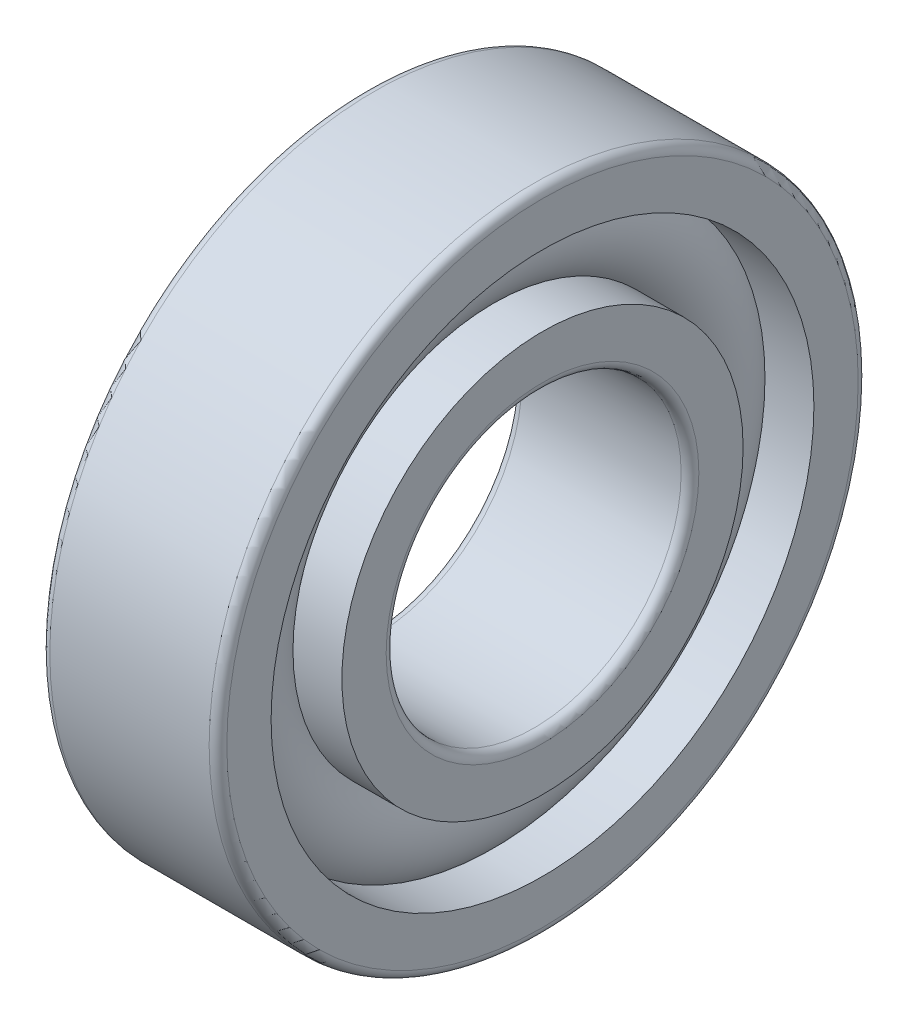
ISO-10303-21;
HEADER;
FILE_DESCRIPTION(('STEP AP214'),'2;1');
FILE_NAME('part.step','',(''),(''),'','','');
FILE_SCHEMA(('AUTOMOTIVE_DESIGN { 1 0 10303 214 1 1 1 1 }'));
ENDSEC;
DATA;
#1=APPLICATION_CONTEXT('core data for automotive mechanical design processes');
#2=APPLICATION_PROTOCOL_DEFINITION('international standard','automotive_design',2000,#1);
#3=PRODUCT_CONTEXT('',#1,'mechanical');
#4=PRODUCT('Part','Part','',(#3));
#5=PRODUCT_RELATED_PRODUCT_CATEGORY('part','',(#4));
#6=PRODUCT_DEFINITION_FORMATION('','',#4);
#7=PRODUCT_DEFINITION_CONTEXT('part definition',#1,'design');
#8=PRODUCT_DEFINITION('design','',#6,#7);
#9=PRODUCT_DEFINITION_SHAPE('','',#8);
#10=(LENGTH_UNIT() NAMED_UNIT(*) SI_UNIT(.MILLI.,.METRE.));
#11=(NAMED_UNIT(*) PLANE_ANGLE_UNIT() SI_UNIT($,.RADIAN.));
#12=(NAMED_UNIT(*) SI_UNIT($,.STERADIAN.) SOLID_ANGLE_UNIT());
#13=UNCERTAINTY_MEASURE_WITH_UNIT(LENGTH_MEASURE(1.E-05),#10,'distance_accuracy_value','');
#14=(GEOMETRIC_REPRESENTATION_CONTEXT(3) GLOBAL_UNCERTAINTY_ASSIGNED_CONTEXT((#13)) GLOBAL_UNIT_ASSIGNED_CONTEXT((#10,
#11,#12)) REPRESENTATION_CONTEXT('',''));
#15=CARTESIAN_POINT('',(0.,0.,0.));
#16=DIRECTION('',(0.,0.,1.));
#17=DIRECTION('',(1.,0.,0.));
#18=AXIS2_PLACEMENT_3D('',#15,#16,#17);
#19=CARTESIAN_POINT('',(0.,0.,0.));
#20=DIRECTION('',(-1.,0.,0.));
#21=DIRECTION('',(0.,0.,1.));
#22=AXIS2_PLACEMENT_3D('',#19,#20,#21);
#23=TOROIDAL_SURFACE('',#22,4.,0.9);
#24=CARTESIAN_POINT('',(0.670820393249932,0.,0.));
#25=DIRECTION('',(-1.,0.,0.));
#26=DIRECTION('',(0.,0.,1.));
#27=AXIS2_PLACEMENT_3D('',#24,#25,#26);
#28=CIRCLE('',#27,4.6);
#29=CARTESIAN_POINT('',(0.670820393249932,0.,4.6));
#30=VERTEX_POINT('',#29);
#31=EDGE_CURVE('E36',#30,#30,#28,.F.);
#32=ORIENTED_EDGE('',*,*,#31,.T.);
#33=EDGE_LOOP('',(#32));
#34=FACE_BOUND('',#33,.T.);
#35=CARTESIAN_POINT('',(0.670820393249936,0.,0.));
#36=DIRECTION('',(-1.,0.,0.));
#37=DIRECTION('',(0.,0.,1.));
#38=AXIS2_PLACEMENT_3D('',#35,#36,#37);
#39=CIRCLE('',#38,3.4);
#40=CARTESIAN_POINT('',(0.670820393249936,0.,3.4));
#41=VERTEX_POINT('',#40);
#42=EDGE_CURVE('E10',#41,#41,#39,.T.);
#43=ORIENTED_EDGE('',*,*,#42,.T.);
#44=EDGE_LOOP('',(#43));
#45=FACE_BOUND('',#44,.T.);
#46=ADVANCED_FACE('F32',(#34,#45),#23,.T.);
#47=CARTESIAN_POINT('',(-20.6375,0.,0.));
#48=DIRECTION('',(1.,0.,0.));
#49=DIRECTION('',(0.,0.,-1.));
#50=AXIS2_PLACEMENT_3D('',#47,#48,#49);
#51=CYLINDRICAL_SURFACE('',#50,3.4);
#52=CARTESIAN_POINT('',(1.5,0.,0.));
#53=DIRECTION('',(1.,0.,0.));
#54=DIRECTION('',(0.,0.,-1.));
#55=AXIS2_PLACEMENT_3D('',#52,#53,#54);
#56=CIRCLE('',#55,3.4);
#57=CARTESIAN_POINT('',(1.5,0.,-3.4));
#58=VERTEX_POINT('',#57);
#59=EDGE_CURVE('E45',#58,#58,#56,.T.);
#60=ORIENTED_EDGE('',*,*,#59,.F.);
#61=EDGE_LOOP('',(#60));
#62=FACE_BOUND('',#61,.T.);
#63=ORIENTED_EDGE('',*,*,#42,.F.);
#64=EDGE_LOOP('',(#63));
#65=FACE_BOUND('',#64,.T.);
#66=ADVANCED_FACE('F84',(#62,#65),#51,.T.);
#67=CARTESIAN_POINT('',(-20.6375,0.,0.));
#68=DIRECTION('',(1.,0.,0.));
#69=DIRECTION('',(0.,0.,-1.));
#70=AXIS2_PLACEMENT_3D('',#67,#68,#69);
#71=CYLINDRICAL_SURFACE('',#70,3.4);
#72=CARTESIAN_POINT('',(-1.5,0.,0.));
#73=DIRECTION('',(1.,0.,0.));
#74=DIRECTION('',(0.,0.,-1.));
#75=AXIS2_PLACEMENT_3D('',#72,#73,#74);
#76=CIRCLE('',#75,3.4);
#77=CARTESIAN_POINT('',(-1.5,0.,-3.4));
#78=VERTEX_POINT('',#77);
#79=EDGE_CURVE('E54',#78,#78,#76,.T.);
#80=ORIENTED_EDGE('',*,*,#79,.T.);
#81=EDGE_LOOP('',(#80));
#82=FACE_BOUND('',#81,.T.);
#83=CARTESIAN_POINT('',(-0.670820393249936,0.,0.));
#84=DIRECTION('',(1.,0.,0.));
#85=DIRECTION('',(0.,0.,-1.));
#86=AXIS2_PLACEMENT_3D('',#83,#84,#85);
#87=CIRCLE('',#86,3.4);
#88=CARTESIAN_POINT('',(-0.670820393249936,0.,-3.4));
#89=VERTEX_POINT('',#88);
#90=EDGE_CURVE('E40',#89,#89,#87,.T.);
#91=ORIENTED_EDGE('',*,*,#90,.F.);
#92=EDGE_LOOP('',(#91));
#93=FACE_BOUND('',#92,.T.);
#94=ADVANCED_FACE('F87',(#82,#93),#71,.T.);
#95=CARTESIAN_POINT('',(1.5,2.65,0.));
#96=DIRECTION('',(1.,0.,0.));
#97=DIRECTION('',(0.,0.,-1.));
#98=AXIS2_PLACEMENT_3D('',#95,#96,#97);
#99=PLANE('',#98);
#100=ORIENTED_EDGE('',*,*,#59,.T.);
#101=EDGE_LOOP('',(#100));
#102=FACE_BOUND('',#101,.T.);
#103=CARTESIAN_POINT('',(1.5,0.,0.));
#104=DIRECTION('',(1.,0.,0.));
#105=DIRECTION('',(0.,0.,-1.));
#106=AXIS2_PLACEMENT_3D('',#103,#104,#105);
#107=CIRCLE('',#106,2.65);
#108=CARTESIAN_POINT('',(1.5,0.,-2.65));
#109=VERTEX_POINT('',#108);
#110=EDGE_CURVE('E76',#109,#109,#107,.T.);
#111=ORIENTED_EDGE('',*,*,#110,.F.);
#112=EDGE_LOOP('',(#111));
#113=FACE_BOUND('',#112,.T.);
#114=ADVANCED_FACE('F81',(#102,#113),#99,.T.);
#115=CARTESIAN_POINT('',(1.35,0.,0.));
#116=DIRECTION('',(1.,0.,0.));
#117=DIRECTION('',(0.,0.,-1.));
#118=AXIS2_PLACEMENT_3D('',#115,#116,#117);
#119=TOROIDAL_SURFACE('',#118,2.65,0.149999999999999);
#120=ORIENTED_EDGE('',*,*,#110,.T.);
#121=EDGE_LOOP('',(#120));
#122=FACE_BOUND('',#121,.T.);
#123=CARTESIAN_POINT('',(1.35,0.,0.));
#124=DIRECTION('',(1.,0.,0.));
#125=DIRECTION('',(0.,0.,-1.));
#126=AXIS2_PLACEMENT_3D('',#123,#124,#125);
#127=CIRCLE('',#126,2.5);
#128=CARTESIAN_POINT('',(1.35,0.,-2.5));
#129=VERTEX_POINT('',#128);
#130=EDGE_CURVE('E73',#129,#129,#127,.T.);
#131=ORIENTED_EDGE('',*,*,#130,.F.);
#132=EDGE_LOOP('',(#131));
#133=FACE_BOUND('',#132,.T.);
#134=ADVANCED_FACE('F98',(#122,#133),#119,.T.);
#135=CARTESIAN_POINT('',(-20.6375,0.,0.));
#136=DIRECTION('',(1.,0.,0.));
#137=DIRECTION('',(0.,0.,-1.));
#138=AXIS2_PLACEMENT_3D('',#135,#136,#137);
#139=CYLINDRICAL_SURFACE('',#138,2.5);
#140=ORIENTED_EDGE('',*,*,#130,.T.);
#141=EDGE_LOOP('',(#140));
#142=FACE_BOUND('',#141,.T.);
#143=CARTESIAN_POINT('',(-1.35,0.,0.));
#144=DIRECTION('',(1.,0.,0.));
#145=DIRECTION('',(0.,0.,-1.));
#146=AXIS2_PLACEMENT_3D('',#143,#144,#145);
#147=CIRCLE('',#146,2.5);
#148=CARTESIAN_POINT('',(-1.35,0.,-2.5));
#149=VERTEX_POINT('',#148);
#150=EDGE_CURVE('E70',#149,#149,#147,.T.);
#151=ORIENTED_EDGE('',*,*,#150,.F.);
#152=EDGE_LOOP('',(#151));
#153=FACE_BOUND('',#152,.T.);
#154=ADVANCED_FACE('F101',(#142,#153),#139,.F.);
#155=CARTESIAN_POINT('',(-1.35,0.,0.));
#156=DIRECTION('',(1.,0.,0.));
#157=DIRECTION('',(0.,0.,-1.));
#158=AXIS2_PLACEMENT_3D('',#155,#156,#157);
#159=TOROIDAL_SURFACE('',#158,2.65,0.149999999999999);
#160=ORIENTED_EDGE('',*,*,#150,.T.);
#161=EDGE_LOOP('',(#160));
#162=FACE_BOUND('',#161,.T.);
#163=CARTESIAN_POINT('',(-1.5,0.,0.));
#164=DIRECTION('',(1.,0.,0.));
#165=DIRECTION('',(0.,0.,-1.));
#166=AXIS2_PLACEMENT_3D('',#163,#164,#165);
#167=CIRCLE('',#166,2.65);
#168=CARTESIAN_POINT('',(-1.5,0.,-2.65));
#169=VERTEX_POINT('',#168);
#170=EDGE_CURVE('E67',#169,#169,#167,.T.);
#171=ORIENTED_EDGE('',*,*,#170,.F.);
#172=EDGE_LOOP('',(#171));
#173=FACE_BOUND('',#172,.T.);
#174=ADVANCED_FACE('F105',(#162,#173),#159,.T.);
#175=CARTESIAN_POINT('',(-1.5,3.4,0.));
#176=DIRECTION('',(-1.,0.,0.));
#177=DIRECTION('',(0.,0.,1.));
#178=AXIS2_PLACEMENT_3D('',#175,#176,#177);
#179=PLANE('',#178);
#180=ORIENTED_EDGE('',*,*,#170,.T.);
#181=EDGE_LOOP('',(#180));
#182=FACE_BOUND('',#181,.T.);
#183=ORIENTED_EDGE('',*,*,#79,.F.);
#184=EDGE_LOOP('',(#183));
#185=FACE_BOUND('',#184,.T.);
#186=ADVANCED_FACE('F109',(#182,#185),#179,.T.);
#187=CARTESIAN_POINT('',(-0.670820393249932,0.,0.));
#188=DIRECTION('',(1.,0.,0.));
#189=DIRECTION('',(0.,0.,-1.));
#190=AXIS2_PLACEMENT_3D('',#187,#188,#189);
#191=CIRCLE('',#190,4.6);
#192=CARTESIAN_POINT('',(-0.670820393249932,0.,-4.6));
#193=VERTEX_POINT('',#192);
#194=EDGE_CURVE('E48',#193,#193,#191,.F.);
#195=ORIENTED_EDGE('',*,*,#194,.T.);
#196=EDGE_LOOP('',(#195));
#197=FACE_BOUND('',#196,.T.);
#198=ORIENTED_EDGE('',*,*,#90,.T.);
#199=EDGE_LOOP('',(#198));
#200=FACE_BOUND('',#199,.T.);
#201=ADVANCED_FACE('F34',(#197,#200),#23,.T.);
#202=CARTESIAN_POINT('',(-20.6375,0.,0.));
#203=DIRECTION('',(1.,0.,0.));
#204=DIRECTION('',(0.,0.,-1.));
#205=AXIS2_PLACEMENT_3D('',#202,#203,#204);
#206=CYLINDRICAL_SURFACE('',#205,4.6);
#207=CARTESIAN_POINT('',(1.5,0.,0.));
#208=DIRECTION('',(1.,0.,0.));
#209=DIRECTION('',(0.,0.,-1.));
#210=AXIS2_PLACEMENT_3D('',#207,#208,#209);
#211=CIRCLE('',#210,4.6);
#212=CARTESIAN_POINT('',(1.5,0.,-4.6));
#213=VERTEX_POINT('',#212);
#214=EDGE_CURVE('E50',#213,#213,#211,.T.);
#215=ORIENTED_EDGE('',*,*,#214,.T.);
#216=EDGE_LOOP('',(#215));
#217=FACE_BOUND('',#216,.T.);
#218=ORIENTED_EDGE('',*,*,#31,.F.);
#219=EDGE_LOOP('',(#218));
#220=FACE_BOUND('',#219,.T.);
#221=ADVANCED_FACE('F114',(#217,#220),#206,.F.);
#222=CARTESIAN_POINT('',(-20.6375,0.,0.));
#223=DIRECTION('',(1.,0.,0.));
#224=DIRECTION('',(0.,0.,-1.));
#225=AXIS2_PLACEMENT_3D('',#222,#223,#224);
#226=CYLINDRICAL_SURFACE('',#225,4.6);
#227=CARTESIAN_POINT('',(-1.5,0.,0.));
#228=DIRECTION('',(1.,0.,0.));
#229=DIRECTION('',(0.,0.,-1.));
#230=AXIS2_PLACEMENT_3D('',#227,#228,#229);
#231=CIRCLE('',#230,4.6);
#232=CARTESIAN_POINT('',(-1.5,0.,-4.6));
#233=VERTEX_POINT('',#232);
#234=EDGE_CURVE('E145',#233,#233,#231,.T.);
#235=ORIENTED_EDGE('',*,*,#234,.F.);
#236=EDGE_LOOP('',(#235));
#237=FACE_BOUND('',#236,.T.);
#238=ORIENTED_EDGE('',*,*,#194,.F.);
#239=EDGE_LOOP('',(#238));
#240=FACE_BOUND('',#239,.T.);
#241=ADVANCED_FACE('F117',(#237,#240),#226,.F.);
#242=CARTESIAN_POINT('',(1.5,5.35,0.));
#243=DIRECTION('',(1.,0.,0.));
#244=DIRECTION('',(0.,0.,-1.));
#245=AXIS2_PLACEMENT_3D('',#242,#243,#244);
#246=PLANE('',#245);
#247=CARTESIAN_POINT('',(1.5,0.,0.));
#248=DIRECTION('',(1.,0.,0.));
#249=DIRECTION('',(0.,0.,-1.));
#250=AXIS2_PLACEMENT_3D('',#247,#248,#249);
#251=CIRCLE('',#250,5.35);
#252=CARTESIAN_POINT('',(1.5,0.,-5.35));
#253=VERTEX_POINT('',#252);
#254=EDGE_CURVE('E56',#253,#253,#251,.T.);
#255=ORIENTED_EDGE('',*,*,#254,.T.);
#256=EDGE_LOOP('',(#255));
#257=FACE_BOUND('',#256,.T.);
#258=ORIENTED_EDGE('',*,*,#214,.F.);
#259=EDGE_LOOP('',(#258));
#260=FACE_BOUND('',#259,.T.);
#261=ADVANCED_FACE('F118',(#257,#260),#246,.T.);
#262=CARTESIAN_POINT('',(1.35,0.,0.));
#263=DIRECTION('',(1.,0.,0.));
#264=DIRECTION('',(0.,0.,-1.));
#265=AXIS2_PLACEMENT_3D('',#262,#263,#264);
#266=TOROIDAL_SURFACE('',#265,5.35,0.149999999999999);
#267=CARTESIAN_POINT('',(1.35,0.,0.));
#268=DIRECTION('',(1.,0.,0.));
#269=DIRECTION('',(0.,0.,-1.));
#270=AXIS2_PLACEMENT_3D('',#267,#268,#269);
#271=CIRCLE('',#270,5.5);
#272=CARTESIAN_POINT('',(1.35,0.,-5.5));
#273=VERTEX_POINT('',#272);
#274=EDGE_CURVE('E61',#273,#273,#271,.T.);
#275=ORIENTED_EDGE('',*,*,#274,.T.);
#276=EDGE_LOOP('',(#275));
#277=FACE_BOUND('',#276,.T.);
#278=ORIENTED_EDGE('',*,*,#254,.F.);
#279=EDGE_LOOP('',(#278));
#280=FACE_BOUND('',#279,.T.);
#281=ADVANCED_FACE('F121',(#277,#280),#266,.T.);
#282=CARTESIAN_POINT('',(-20.6375,0.,0.));
#283=DIRECTION('',(1.,0.,0.));
#284=DIRECTION('',(0.,0.,-1.));
#285=AXIS2_PLACEMENT_3D('',#282,#283,#284);
#286=CYLINDRICAL_SURFACE('',#285,5.5);
#287=CARTESIAN_POINT('',(-1.35,0.,0.));
#288=DIRECTION('',(1.,0.,0.));
#289=DIRECTION('',(0.,0.,-1.));
#290=AXIS2_PLACEMENT_3D('',#287,#288,#289);
#291=CIRCLE('',#290,5.5);
#292=CARTESIAN_POINT('',(-1.35,0.,-5.5));
#293=VERTEX_POINT('',#292);
#294=EDGE_CURVE('E149',#293,#293,#291,.T.);
#295=ORIENTED_EDGE('',*,*,#294,.T.);
#296=EDGE_LOOP('',(#295));
#297=FACE_BOUND('',#296,.T.);
#298=ORIENTED_EDGE('',*,*,#274,.F.);
#299=EDGE_LOOP('',(#298));
#300=FACE_BOUND('',#299,.T.);
#301=ADVANCED_FACE('F125',(#297,#300),#286,.T.);
#302=CARTESIAN_POINT('',(-1.35,0.,0.));
#303=DIRECTION('',(1.,0.,0.));
#304=DIRECTION('',(0.,0.,-1.));
#305=AXIS2_PLACEMENT_3D('',#302,#303,#304);
#306=TOROIDAL_SURFACE('',#305,5.35,0.149999999999999);
#307=CARTESIAN_POINT('',(-1.5,0.,0.));
#308=DIRECTION('',(1.,0.,0.));
#309=DIRECTION('',(0.,0.,-1.));
#310=AXIS2_PLACEMENT_3D('',#307,#308,#309);
#311=CIRCLE('',#310,5.35);
#312=CARTESIAN_POINT('',(-1.5,0.,-5.35));
#313=VERTEX_POINT('',#312);
#314=EDGE_CURVE('E146',#313,#313,#311,.T.);
#315=ORIENTED_EDGE('',*,*,#314,.T.);
#316=EDGE_LOOP('',(#315));
#317=FACE_BOUND('',#316,.T.);
#318=ORIENTED_EDGE('',*,*,#294,.F.);
#319=EDGE_LOOP('',(#318));
#320=FACE_BOUND('',#319,.T.);
#321=ADVANCED_FACE('F129',(#317,#320),#306,.T.);
#322=CARTESIAN_POINT('',(-1.5,4.6,0.));
#323=DIRECTION('',(-1.,0.,0.));
#324=DIRECTION('',(0.,0.,1.));
#325=AXIS2_PLACEMENT_3D('',#322,#323,#324);
#326=PLANE('',#325);
#327=ORIENTED_EDGE('',*,*,#234,.T.);
#328=EDGE_LOOP('',(#327));
#329=FACE_BOUND('',#328,.T.);
#330=ORIENTED_EDGE('',*,*,#314,.F.);
#331=EDGE_LOOP('',(#330));
#332=FACE_BOUND('',#331,.T.);
#333=ADVANCED_FACE('F133',(#329,#332),#326,.T.);
#334=CLOSED_SHELL('',(#46,#66,#94,#114,#134,#154,#174,#186,#201,#221,#241,#261,#281,#301,#321,#333));
#335=MANIFOLD_SOLID_BREP('B2',#334);
#336=ADVANCED_BREP_SHAPE_REPRESENTATION('',(#18,#335),#14);
#337=SHAPE_DEFINITION_REPRESENTATION(#9,#336);
ENDSEC;
END-ISO-10303-21;
